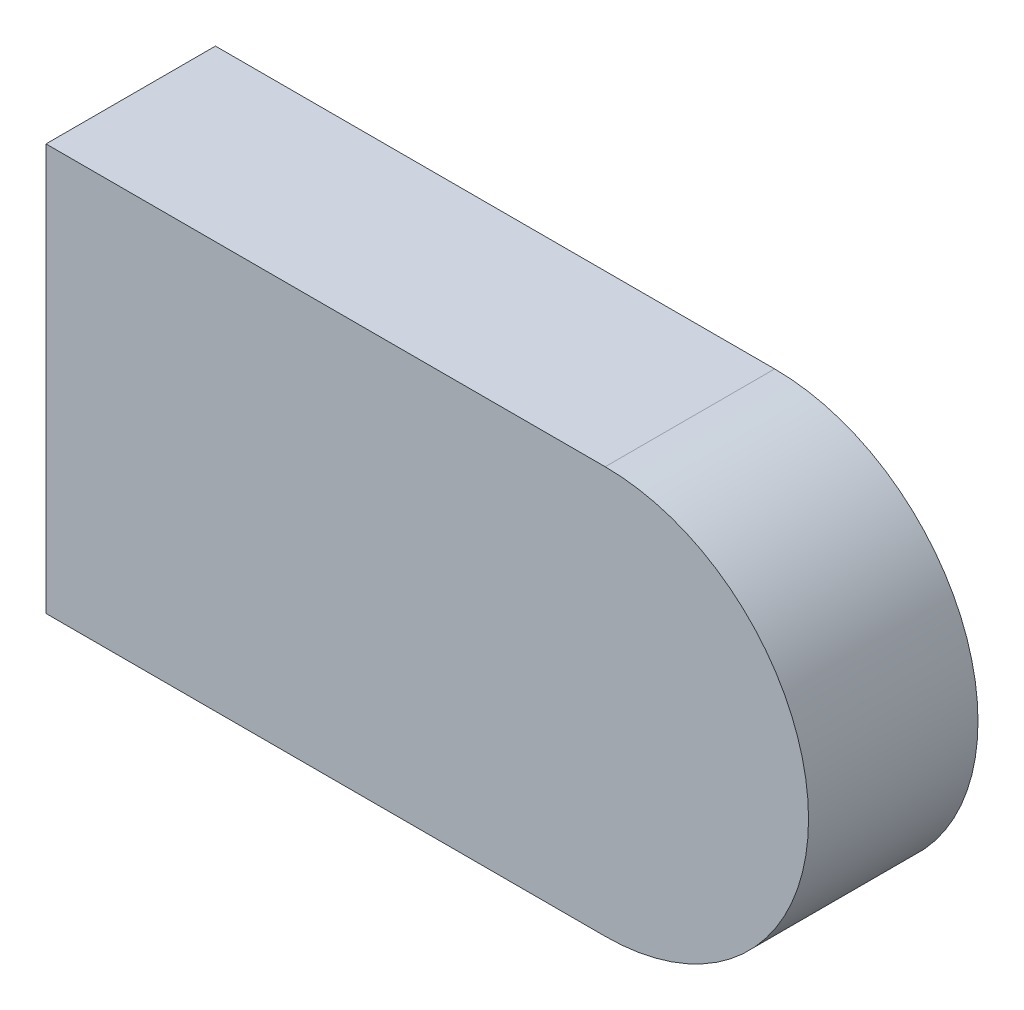
ISO-10303-21;
HEADER;
FILE_DESCRIPTION(('STEP AP214'),'2;1');
FILE_NAME('part.step','',(''),(''),'','','');
FILE_SCHEMA(('AUTOMOTIVE_DESIGN { 1 0 10303 214 1 1 1 1 }'));
ENDSEC;
DATA;
#1=APPLICATION_CONTEXT('core data for automotive mechanical design processes');
#2=APPLICATION_PROTOCOL_DEFINITION('international standard','automotive_design',2000,#1);
#3=PRODUCT_CONTEXT('',#1,'mechanical');
#4=PRODUCT('Part','Part','',(#3));
#5=PRODUCT_RELATED_PRODUCT_CATEGORY('part','',(#4));
#6=PRODUCT_DEFINITION_FORMATION('','',#4);
#7=PRODUCT_DEFINITION_CONTEXT('part definition',#1,'design');
#8=PRODUCT_DEFINITION('design','',#6,#7);
#9=PRODUCT_DEFINITION_SHAPE('','',#8);
#10=(LENGTH_UNIT() NAMED_UNIT(*) SI_UNIT(.MILLI.,.METRE.));
#11=(NAMED_UNIT(*) PLANE_ANGLE_UNIT() SI_UNIT($,.RADIAN.));
#12=(NAMED_UNIT(*) SI_UNIT($,.STERADIAN.) SOLID_ANGLE_UNIT());
#13=UNCERTAINTY_MEASURE_WITH_UNIT(LENGTH_MEASURE(1.E-05),#10,'distance_accuracy_value','');
#14=(GEOMETRIC_REPRESENTATION_CONTEXT(3) GLOBAL_UNCERTAINTY_ASSIGNED_CONTEXT((#13)) GLOBAL_UNIT_ASSIGNED_CONTEXT((#10,
#11,#12)) REPRESENTATION_CONTEXT('',''));
#15=CARTESIAN_POINT('',(0.,0.,0.));
#16=DIRECTION('',(0.,0.,1.));
#17=DIRECTION('',(1.,0.,0.));
#18=AXIS2_PLACEMENT_3D('',#15,#16,#17);
#19=CARTESIAN_POINT('',(-4.05,-0.37,0.));
#20=DIRECTION('',(0.,1.,0.));
#21=DIRECTION('',(1.,0.,0.));
#22=AXIS2_PLACEMENT_3D('',#19,#20,#21);
#23=PLANE('',#22);
#24=DIRECTION('',(1.,0.,0.));
#25=VECTOR('',#24,1.);
#26=CARTESIAN_POINT('',(-4.05,-0.37,0.));
#27=LINE('',#26,#25);
#28=CARTESIAN_POINT('',(-4.05,-0.37,0.));
#29=VERTEX_POINT('',#28);
#30=CARTESIAN_POINT('',(-3.72,-0.37,0.));
#31=VERTEX_POINT('',#30);
#32=EDGE_CURVE('E11',#29,#31,#27,.T.);
#33=ORIENTED_EDGE('',*,*,#32,.T.);
#34=DIRECTION('',(0.,0.,1.));
#35=VECTOR('',#34,1.);
#36=CARTESIAN_POINT('',(-3.72,-0.37,0.));
#37=LINE('',#36,#35);
#38=CARTESIAN_POINT('',(-3.72,-0.37,0.1));
#39=VERTEX_POINT('',#38);
#40=EDGE_CURVE('E24',#31,#39,#37,.T.);
#41=ORIENTED_EDGE('',*,*,#40,.T.);
#42=DIRECTION('',(1.,0.,0.));
#43=VECTOR('',#42,1.);
#44=CARTESIAN_POINT('',(-4.05,-0.37,0.1));
#45=LINE('',#44,#43);
#46=CARTESIAN_POINT('',(-4.05,-0.37,0.1));
#47=VERTEX_POINT('',#46);
#48=EDGE_CURVE('E88',#47,#39,#45,.T.);
#49=ORIENTED_EDGE('',*,*,#48,.F.);
#50=DIRECTION('',(0.,0.,1.));
#51=VECTOR('',#50,1.);
#52=CARTESIAN_POINT('',(-4.05,-0.37,0.));
#53=LINE('',#52,#51);
#54=EDGE_CURVE('E36',#29,#47,#53,.T.);
#55=ORIENTED_EDGE('',*,*,#54,.F.);
#56=EDGE_LOOP('',(#33,#41,#49,#55));
#57=FACE_BOUND('',#56,.T.);
#58=ADVANCED_FACE('F17',(#57),#23,.F.);
#59=CARTESIAN_POINT('',(-3.72,-0.25,0.));
#60=DIRECTION('',(0.,0.,-1.));
#61=DIRECTION('',(1.,0.,0.));
#62=AXIS2_PLACEMENT_3D('',#59,#60,#61);
#63=CYLINDRICAL_SURFACE('',#62,0.12);
#64=CARTESIAN_POINT('',(-3.72,-0.25,0.));
#65=DIRECTION('',(0.,0.,1.));
#66=DIRECTION('',(1.,0.,0.));
#67=AXIS2_PLACEMENT_3D('',#64,#65,#66);
#68=CIRCLE('',#67,0.12);
#69=CARTESIAN_POINT('',(-3.72,-0.13,0.));
#70=VERTEX_POINT('',#69);
#71=EDGE_CURVE('E85',#31,#70,#68,.T.);
#72=ORIENTED_EDGE('',*,*,#71,.T.);
#73=DIRECTION('',(0.,0.,1.));
#74=VECTOR('',#73,1.);
#75=CARTESIAN_POINT('',(-3.72,-0.13,0.));
#76=LINE('',#75,#74);
#77=CARTESIAN_POINT('',(-3.72,-0.13,0.1));
#78=VERTEX_POINT('',#77);
#79=EDGE_CURVE('E73',#70,#78,#76,.T.);
#80=ORIENTED_EDGE('',*,*,#79,.T.);
#81=CARTESIAN_POINT('',(-3.72,-0.25,0.1));
#82=DIRECTION('',(0.,0.,1.));
#83=DIRECTION('',(1.,0.,0.));
#84=AXIS2_PLACEMENT_3D('',#81,#82,#83);
#85=CIRCLE('',#84,0.12);
#86=EDGE_CURVE('E66',#39,#78,#85,.T.);
#87=ORIENTED_EDGE('',*,*,#86,.F.);
#88=ORIENTED_EDGE('',*,*,#40,.F.);
#89=EDGE_LOOP('',(#72,#80,#87,#88));
#90=FACE_BOUND('',#89,.T.);
#91=ADVANCED_FACE('F89',(#90),#63,.T.);
#92=CARTESIAN_POINT('',(-4.05,-0.13,0.));
#93=DIRECTION('',(0.,1.,0.));
#94=DIRECTION('',(1.,0.,0.));
#95=AXIS2_PLACEMENT_3D('',#92,#93,#94);
#96=PLANE('',#95);
#97=DIRECTION('',(0.,0.,1.));
#98=VECTOR('',#97,1.);
#99=CARTESIAN_POINT('',(-4.05,-0.13,0.));
#100=LINE('',#99,#98);
#101=CARTESIAN_POINT('',(-4.05,-0.13,0.));
#102=VERTEX_POINT('',#101);
#103=CARTESIAN_POINT('',(-4.05,-0.13,0.1));
#104=VERTEX_POINT('',#103);
#105=EDGE_CURVE('E56',#102,#104,#100,.T.);
#106=ORIENTED_EDGE('',*,*,#105,.T.);
#107=DIRECTION('',(1.,0.,0.));
#108=VECTOR('',#107,1.);
#109=CARTESIAN_POINT('',(-4.05,-0.13,0.1));
#110=LINE('',#109,#108);
#111=EDGE_CURVE('E67',#104,#78,#110,.T.);
#112=ORIENTED_EDGE('',*,*,#111,.T.);
#113=ORIENTED_EDGE('',*,*,#79,.F.);
#114=DIRECTION('',(1.,0.,0.));
#115=VECTOR('',#114,1.);
#116=CARTESIAN_POINT('',(-4.05,-0.13,0.));
#117=LINE('',#116,#115);
#118=EDGE_CURVE('E71',#102,#70,#117,.T.);
#119=ORIENTED_EDGE('',*,*,#118,.F.);
#120=EDGE_LOOP('',(#106,#112,#113,#119));
#121=FACE_BOUND('',#120,.T.);
#122=ADVANCED_FACE('F72',(#121),#96,.T.);
#123=CARTESIAN_POINT('',(-4.05,-0.37,0.));
#124=DIRECTION('',(-1.,0.,0.));
#125=DIRECTION('',(0.,1.,0.));
#126=AXIS2_PLACEMENT_3D('',#123,#124,#125);
#127=PLANE('',#126);
#128=ORIENTED_EDGE('',*,*,#54,.T.);
#129=DIRECTION('',(0.,1.,0.));
#130=VECTOR('',#129,1.);
#131=CARTESIAN_POINT('',(-4.05,-0.37,0.1));
#132=LINE('',#131,#130);
#133=EDGE_CURVE('E62',#47,#104,#132,.T.);
#134=ORIENTED_EDGE('',*,*,#133,.T.);
#135=ORIENTED_EDGE('',*,*,#105,.F.);
#136=DIRECTION('',(0.,1.,0.));
#137=VECTOR('',#136,1.);
#138=CARTESIAN_POINT('',(-4.05,-0.37,0.));
#139=LINE('',#138,#137);
#140=EDGE_CURVE('E60',#29,#102,#139,.T.);
#141=ORIENTED_EDGE('',*,*,#140,.F.);
#142=EDGE_LOOP('',(#128,#134,#135,#141));
#143=FACE_BOUND('',#142,.T.);
#144=ADVANCED_FACE('F58',(#143),#127,.T.);
#145=CARTESIAN_POINT('',(-3.849490847913,-0.25,0.));
#146=DIRECTION('',(0.,0.,1.));
#147=DIRECTION('',(1.,0.,0.));
#148=AXIS2_PLACEMENT_3D('',#145,#146,#147);
#149=PLANE('',#148);
#150=ORIENTED_EDGE('',*,*,#140,.T.);
#151=ORIENTED_EDGE('',*,*,#118,.T.);
#152=ORIENTED_EDGE('',*,*,#71,.F.);
#153=ORIENTED_EDGE('',*,*,#32,.F.);
#154=EDGE_LOOP('',(#150,#151,#152,#153));
#155=FACE_BOUND('',#154,.T.);
#156=ADVANCED_FACE('F77',(#155),#149,.F.);
#157=CARTESIAN_POINT('',(-3.849490847913,-0.25,0.1));
#158=DIRECTION('',(0.,0.,1.));
#159=DIRECTION('',(1.,0.,0.));
#160=AXIS2_PLACEMENT_3D('',#157,#158,#159);
#161=PLANE('',#160);
#162=ORIENTED_EDGE('',*,*,#48,.T.);
#163=ORIENTED_EDGE('',*,*,#86,.T.);
#164=ORIENTED_EDGE('',*,*,#111,.F.);
#165=ORIENTED_EDGE('',*,*,#133,.F.);
#166=EDGE_LOOP('',(#162,#163,#164,#165));
#167=FACE_BOUND('',#166,.T.);
#168=ADVANCED_FACE('F91',(#167),#161,.T.);
#169=CLOSED_SHELL('',(#58,#91,#122,#144,#156,#168));
#170=MANIFOLD_SOLID_BREP('B1',#169);
#171=ADVANCED_BREP_SHAPE_REPRESENTATION('',(#18,#170),#14);
#172=SHAPE_DEFINITION_REPRESENTATION(#9,#171);
ENDSEC;
END-ISO-10303-21;
